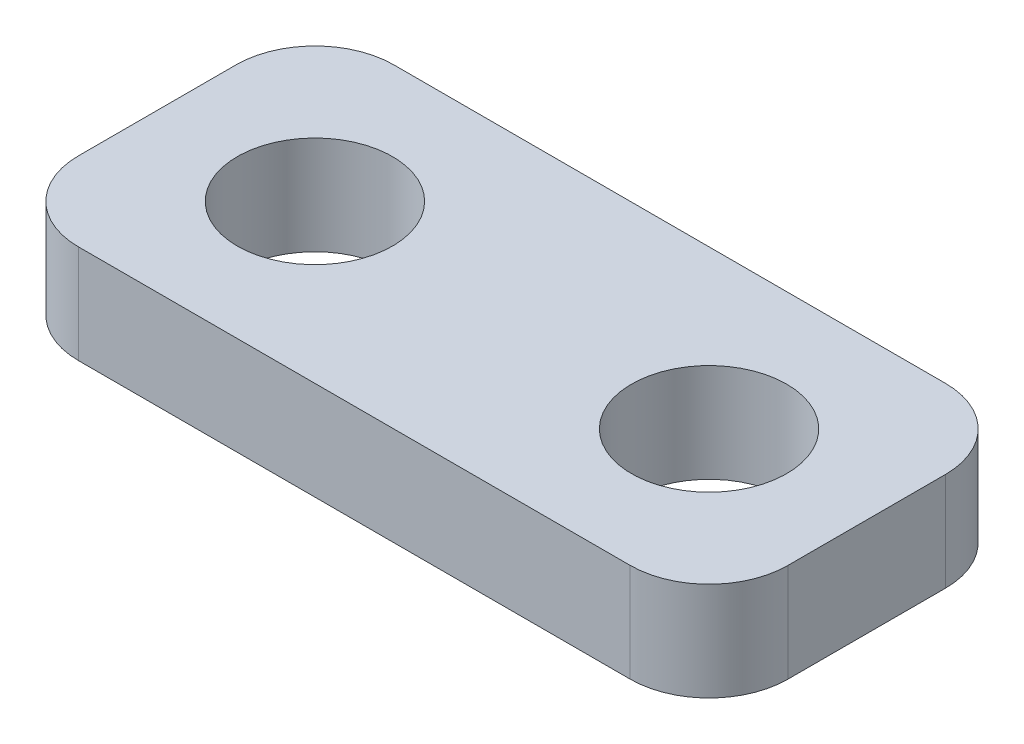
ISO-10303-21;
HEADER;
FILE_DESCRIPTION(('STEP AP214'),'2;1');
FILE_NAME('part.step','',(''),(''),'','','');
FILE_SCHEMA(('AUTOMOTIVE_DESIGN { 1 0 10303 214 1 1 1 1 }'));
ENDSEC;
DATA;
#1=APPLICATION_CONTEXT('core data for automotive mechanical design processes');
#2=APPLICATION_PROTOCOL_DEFINITION('international standard','automotive_design',2000,#1);
#3=PRODUCT_CONTEXT('',#1,'mechanical');
#4=PRODUCT('Part','Part','',(#3));
#5=PRODUCT_RELATED_PRODUCT_CATEGORY('part','',(#4));
#6=PRODUCT_DEFINITION_FORMATION('','',#4);
#7=PRODUCT_DEFINITION_CONTEXT('part definition',#1,'design');
#8=PRODUCT_DEFINITION('design','',#6,#7);
#9=PRODUCT_DEFINITION_SHAPE('','',#8);
#10=(LENGTH_UNIT() NAMED_UNIT(*) SI_UNIT(.MILLI.,.METRE.));
#11=(NAMED_UNIT(*) PLANE_ANGLE_UNIT() SI_UNIT($,.RADIAN.));
#12=(NAMED_UNIT(*) SI_UNIT($,.STERADIAN.) SOLID_ANGLE_UNIT());
#13=UNCERTAINTY_MEASURE_WITH_UNIT(LENGTH_MEASURE(1.E-05),#10,'distance_accuracy_value','');
#14=(GEOMETRIC_REPRESENTATION_CONTEXT(3) GLOBAL_UNCERTAINTY_ASSIGNED_CONTEXT((#13)) GLOBAL_UNIT_ASSIGNED_CONTEXT((#10,
#11,#12)) REPRESENTATION_CONTEXT('',''));
#15=CARTESIAN_POINT('',(0.,0.,0.));
#16=DIRECTION('',(0.,0.,1.));
#17=DIRECTION('',(1.,0.,0.));
#18=AXIS2_PLACEMENT_3D('',#15,#16,#17);
#19=CARTESIAN_POINT('',(11.43,3.175,5.08));
#20=DIRECTION('',(-1.,0.,0.));
#21=DIRECTION('',(0.,0.,1.));
#22=AXIS2_PLACEMENT_3D('',#19,#20,#21);
#23=PLANE('',#22);
#24=DIRECTION('',(0.,0.,-1.));
#25=VECTOR('',#24,1.);
#26=CARTESIAN_POINT('',(11.43,3.175,5.08));
#27=LINE('',#26,#25);
#28=CARTESIAN_POINT('',(11.43,3.175,2.54));
#29=VERTEX_POINT('',#28);
#30=CARTESIAN_POINT('',(11.43,3.175,-2.54));
#31=VERTEX_POINT('',#30);
#32=EDGE_CURVE('E124',#29,#31,#27,.T.);
#33=ORIENTED_EDGE('',*,*,#32,.F.);
#34=DIRECTION('',(0.,-1.,0.));
#35=VECTOR('',#34,1.);
#36=CARTESIAN_POINT('',(11.43,3.175,2.54));
#37=LINE('',#36,#35);
#38=CARTESIAN_POINT('',(11.43,0.,2.54));
#39=VERTEX_POINT('',#38);
#40=EDGE_CURVE('E109',#29,#39,#37,.T.);
#41=ORIENTED_EDGE('',*,*,#40,.T.);
#42=DIRECTION('',(0.,0.,-1.));
#43=VECTOR('',#42,1.);
#44=CARTESIAN_POINT('',(11.43,0.,5.08));
#45=LINE('',#44,#43);
#46=CARTESIAN_POINT('',(11.43,0.,-2.54));
#47=VERTEX_POINT('',#46);
#48=EDGE_CURVE('E121',#39,#47,#45,.T.);
#49=ORIENTED_EDGE('',*,*,#48,.T.);
#50=DIRECTION('',(0.,-1.,0.));
#51=VECTOR('',#50,1.);
#52=CARTESIAN_POINT('',(11.43,3.175,-2.54));
#53=LINE('',#52,#51);
#54=EDGE_CURVE('E126',#47,#31,#53,.F.);
#55=ORIENTED_EDGE('',*,*,#54,.T.);
#56=EDGE_LOOP('',(#33,#41,#49,#55));
#57=FACE_BOUND('',#56,.T.);
#58=ADVANCED_FACE('F39',(#57),#23,.F.);
#59=CARTESIAN_POINT('',(-11.43,3.175,-5.08));
#60=DIRECTION('',(0.,0.,1.));
#61=DIRECTION('',(1.,0.,0.));
#62=AXIS2_PLACEMENT_3D('',#59,#60,#61);
#63=PLANE('',#62);
#64=DIRECTION('',(-1.,0.,0.));
#65=VECTOR('',#64,1.);
#66=CARTESIAN_POINT('',(-11.43,0.,-5.08));
#67=LINE('',#66,#65);
#68=CARTESIAN_POINT('',(8.89,0.,-5.08));
#69=VERTEX_POINT('',#68);
#70=CARTESIAN_POINT('',(-8.89,0.,-5.08));
#71=VERTEX_POINT('',#70);
#72=EDGE_CURVE('E130',#69,#71,#67,.T.);
#73=ORIENTED_EDGE('',*,*,#72,.T.);
#74=DIRECTION('',(0.,-1.,0.));
#75=VECTOR('',#74,1.);
#76=CARTESIAN_POINT('',(-8.89,3.175,-5.08));
#77=LINE('',#76,#75);
#78=CARTESIAN_POINT('',(-8.89,3.175,-5.08));
#79=VERTEX_POINT('',#78);
#80=EDGE_CURVE('E11',#71,#79,#77,.F.);
#81=ORIENTED_EDGE('',*,*,#80,.T.);
#82=DIRECTION('',(-1.,0.,0.));
#83=VECTOR('',#82,1.);
#84=CARTESIAN_POINT('',(-11.43,3.175,-5.08));
#85=LINE('',#84,#83);
#86=CARTESIAN_POINT('',(8.89,3.175,-5.08));
#87=VERTEX_POINT('',#86);
#88=EDGE_CURVE('E170',#87,#79,#85,.T.);
#89=ORIENTED_EDGE('',*,*,#88,.F.);
#90=DIRECTION('',(0.,-1.,0.));
#91=VECTOR('',#90,1.);
#92=CARTESIAN_POINT('',(8.89,3.175,-5.08));
#93=LINE('',#92,#91);
#94=EDGE_CURVE('E47',#87,#69,#93,.T.);
#95=ORIENTED_EDGE('',*,*,#94,.T.);
#96=EDGE_LOOP('',(#73,#81,#89,#95));
#97=FACE_BOUND('',#96,.T.);
#98=ADVANCED_FACE('F168',(#97),#63,.F.);
#99=CARTESIAN_POINT('',(-11.43,3.175,5.08));
#100=DIRECTION('',(1.,0.,0.));
#101=DIRECTION('',(0.,0.,-1.));
#102=AXIS2_PLACEMENT_3D('',#99,#100,#101);
#103=PLANE('',#102);
#104=DIRECTION('',(0.,0.,1.));
#105=VECTOR('',#104,1.);
#106=CARTESIAN_POINT('',(-11.43,0.,5.08));
#107=LINE('',#106,#105);
#108=CARTESIAN_POINT('',(-11.43,0.,-2.54));
#109=VERTEX_POINT('',#108);
#110=CARTESIAN_POINT('',(-11.43,0.,2.54));
#111=VERTEX_POINT('',#110);
#112=EDGE_CURVE('E134',#109,#111,#107,.T.);
#113=ORIENTED_EDGE('',*,*,#112,.T.);
#114=DIRECTION('',(0.,-1.,0.));
#115=VECTOR('',#114,1.);
#116=CARTESIAN_POINT('',(-11.43,3.175,2.54));
#117=LINE('',#116,#115);
#118=CARTESIAN_POINT('',(-11.43,3.175,2.54));
#119=VERTEX_POINT('',#118);
#120=EDGE_CURVE('E54',#111,#119,#117,.F.);
#121=ORIENTED_EDGE('',*,*,#120,.T.);
#122=DIRECTION('',(0.,0.,1.));
#123=VECTOR('',#122,1.);
#124=CARTESIAN_POINT('',(-11.43,3.175,5.08));
#125=LINE('',#124,#123);
#126=CARTESIAN_POINT('',(-11.43,3.175,-2.54));
#127=VERTEX_POINT('',#126);
#128=EDGE_CURVE('E178',#127,#119,#125,.T.);
#129=ORIENTED_EDGE('',*,*,#128,.F.);
#130=DIRECTION('',(0.,-1.,0.));
#131=VECTOR('',#130,1.);
#132=CARTESIAN_POINT('',(-11.43,3.175,-2.54));
#133=LINE('',#132,#131);
#134=EDGE_CURVE('E161',#127,#109,#133,.T.);
#135=ORIENTED_EDGE('',*,*,#134,.T.);
#136=EDGE_LOOP('',(#113,#121,#129,#135));
#137=FACE_BOUND('',#136,.T.);
#138=ADVANCED_FACE('F177',(#137),#103,.F.);
#139=CARTESIAN_POINT('',(-11.43,3.175,5.08));
#140=DIRECTION('',(0.,0.,-1.));
#141=DIRECTION('',(-1.,0.,0.));
#142=AXIS2_PLACEMENT_3D('',#139,#140,#141);
#143=PLANE('',#142);
#144=DIRECTION('',(1.,0.,0.));
#145=VECTOR('',#144,1.);
#146=CARTESIAN_POINT('',(-11.43,0.,5.08));
#147=LINE('',#146,#145);
#148=CARTESIAN_POINT('',(-8.89,0.,5.08));
#149=VERTEX_POINT('',#148);
#150=CARTESIAN_POINT('',(8.89,0.,5.08));
#151=VERTEX_POINT('',#150);
#152=EDGE_CURVE('E144',#149,#151,#147,.T.);
#153=ORIENTED_EDGE('',*,*,#152,.T.);
#154=DIRECTION('',(0.,-1.,0.));
#155=VECTOR('',#154,1.);
#156=CARTESIAN_POINT('',(8.89,3.175,5.08));
#157=LINE('',#156,#155);
#158=CARTESIAN_POINT('',(8.89,3.175,5.08));
#159=VERTEX_POINT('',#158);
#160=EDGE_CURVE('E110',#151,#159,#157,.F.);
#161=ORIENTED_EDGE('',*,*,#160,.T.);
#162=DIRECTION('',(1.,0.,0.));
#163=VECTOR('',#162,1.);
#164=CARTESIAN_POINT('',(-11.43,3.175,5.08));
#165=LINE('',#164,#163);
#166=CARTESIAN_POINT('',(-8.89,3.175,5.08));
#167=VERTEX_POINT('',#166);
#168=EDGE_CURVE('E140',#167,#159,#165,.T.);
#169=ORIENTED_EDGE('',*,*,#168,.F.);
#170=DIRECTION('',(0.,-1.,0.));
#171=VECTOR('',#170,1.);
#172=CARTESIAN_POINT('',(-8.89,3.175,5.08));
#173=LINE('',#172,#171);
#174=EDGE_CURVE('E115',#167,#149,#173,.T.);
#175=ORIENTED_EDGE('',*,*,#174,.T.);
#176=EDGE_LOOP('',(#153,#161,#169,#175));
#177=FACE_BOUND('',#176,.T.);
#178=ADVANCED_FACE('F198',(#177),#143,.F.);
#179=CARTESIAN_POINT('',(0.,3.175,0.));
#180=DIRECTION('',(0.,-1.,0.));
#181=DIRECTION('',(0.,0.,-1.));
#182=AXIS2_PLACEMENT_3D('',#179,#180,#181);
#183=PLANE('',#182);
#184=CARTESIAN_POINT('',(-6.35,3.175,0.));
#185=DIRECTION('',(0.,1.,0.));
#186=DIRECTION('',(0.,0.,1.));
#187=AXIS2_PLACEMENT_3D('',#184,#185,#186);
#188=CIRCLE('',#187,2.5);
#189=CARTESIAN_POINT('',(-6.35,3.175,2.5));
#190=VERTEX_POINT('',#189);
#191=EDGE_CURVE('E137',#190,#190,#188,.T.);
#192=ORIENTED_EDGE('',*,*,#191,.F.);
#193=EDGE_LOOP('',(#192));
#194=FACE_BOUND('',#193,.T.);
#195=CARTESIAN_POINT('',(6.35,3.175,0.));
#196=DIRECTION('',(0.,1.,0.));
#197=DIRECTION('',(0.,0.,-1.));
#198=AXIS2_PLACEMENT_3D('',#195,#196,#197);
#199=CIRCLE('',#198,2.5);
#200=CARTESIAN_POINT('',(6.35,3.175,-2.5));
#201=VERTEX_POINT('',#200);
#202=EDGE_CURVE('E187',#201,#201,#199,.T.);
#203=ORIENTED_EDGE('',*,*,#202,.F.);
#204=EDGE_LOOP('',(#203));
#205=FACE_BOUND('',#204,.T.);
#206=ORIENTED_EDGE('',*,*,#168,.T.);
#207=CARTESIAN_POINT('',(8.89,3.175,2.54));
#208=DIRECTION('',(0.,-1.,0.));
#209=DIRECTION('',(0.,0.,-1.));
#210=AXIS2_PLACEMENT_3D('',#207,#208,#209);
#211=CIRCLE('',#210,2.54);
#212=EDGE_CURVE('E159',#159,#29,#211,.F.);
#213=ORIENTED_EDGE('',*,*,#212,.T.);
#214=ORIENTED_EDGE('',*,*,#32,.T.);
#215=CARTESIAN_POINT('',(8.89,3.175,-2.54));
#216=DIRECTION('',(0.,-1.,0.));
#217=DIRECTION('',(0.,0.,-1.));
#218=AXIS2_PLACEMENT_3D('',#215,#216,#217);
#219=CIRCLE('',#218,2.54);
#220=EDGE_CURVE('E154',#31,#87,#219,.F.);
#221=ORIENTED_EDGE('',*,*,#220,.T.);
#222=ORIENTED_EDGE('',*,*,#88,.T.);
#223=CARTESIAN_POINT('',(-8.89,3.175,-2.54));
#224=DIRECTION('',(0.,-1.,0.));
#225=DIRECTION('',(0.,0.,-1.));
#226=AXIS2_PLACEMENT_3D('',#223,#224,#225);
#227=CIRCLE('',#226,2.54);
#228=EDGE_CURVE('E61',#79,#127,#227,.F.);
#229=ORIENTED_EDGE('',*,*,#228,.T.);
#230=ORIENTED_EDGE('',*,*,#128,.T.);
#231=CARTESIAN_POINT('',(-8.89,3.175,2.54));
#232=DIRECTION('',(0.,-1.,0.));
#233=DIRECTION('',(0.,0.,-1.));
#234=AXIS2_PLACEMENT_3D('',#231,#232,#233);
#235=CIRCLE('',#234,2.54);
#236=EDGE_CURVE('E157',#119,#167,#235,.F.);
#237=ORIENTED_EDGE('',*,*,#236,.T.);
#238=EDGE_LOOP('',(#206,#213,#214,#221,#222,#229,#230,#237));
#239=FACE_BOUND('',#238,.T.);
#240=ADVANCED_FACE('F195',(#194,#205,#239),#183,.F.);
#241=CARTESIAN_POINT('',(0.,0.,0.));
#242=DIRECTION('',(0.,-1.,0.));
#243=DIRECTION('',(0.,0.,-1.));
#244=AXIS2_PLACEMENT_3D('',#241,#242,#243);
#245=PLANE('',#244);
#246=CARTESIAN_POINT('',(-6.35,0.,0.));
#247=DIRECTION('',(0.,1.,0.));
#248=DIRECTION('',(0.,0.,1.));
#249=AXIS2_PLACEMENT_3D('',#246,#247,#248);
#250=CIRCLE('',#249,2.5);
#251=CARTESIAN_POINT('',(-6.35,0.,2.5));
#252=VERTEX_POINT('',#251);
#253=EDGE_CURVE('E131',#252,#252,#250,.T.);
#254=ORIENTED_EDGE('',*,*,#253,.T.);
#255=EDGE_LOOP('',(#254));
#256=FACE_BOUND('',#255,.T.);
#257=CARTESIAN_POINT('',(6.35,0.,0.));
#258=DIRECTION('',(0.,1.,0.));
#259=DIRECTION('',(0.,0.,-1.));
#260=AXIS2_PLACEMENT_3D('',#257,#258,#259);
#261=CIRCLE('',#260,2.5);
#262=CARTESIAN_POINT('',(6.35,0.,-2.5));
#263=VERTEX_POINT('',#262);
#264=EDGE_CURVE('E184',#263,#263,#261,.T.);
#265=ORIENTED_EDGE('',*,*,#264,.T.);
#266=EDGE_LOOP('',(#265));
#267=FACE_BOUND('',#266,.T.);
#268=ORIENTED_EDGE('',*,*,#48,.F.);
#269=CARTESIAN_POINT('',(8.89,0.,2.54));
#270=DIRECTION('',(0.,-1.,0.));
#271=DIRECTION('',(0.,0.,-1.));
#272=AXIS2_PLACEMENT_3D('',#269,#270,#271);
#273=CIRCLE('',#272,2.54);
#274=EDGE_CURVE('E105',#39,#151,#273,.T.);
#275=ORIENTED_EDGE('',*,*,#274,.T.);
#276=ORIENTED_EDGE('',*,*,#152,.F.);
#277=CARTESIAN_POINT('',(-8.89,0.,2.54));
#278=DIRECTION('',(0.,-1.,0.));
#279=DIRECTION('',(0.,0.,-1.));
#280=AXIS2_PLACEMENT_3D('',#277,#278,#279);
#281=CIRCLE('',#280,2.54);
#282=EDGE_CURVE('E116',#149,#111,#281,.T.);
#283=ORIENTED_EDGE('',*,*,#282,.T.);
#284=ORIENTED_EDGE('',*,*,#112,.F.);
#285=CARTESIAN_POINT('',(-8.89,0.,-2.54));
#286=DIRECTION('',(0.,-1.,0.));
#287=DIRECTION('',(0.,0.,-1.));
#288=AXIS2_PLACEMENT_3D('',#285,#286,#287);
#289=CIRCLE('',#288,2.54);
#290=EDGE_CURVE('E148',#109,#71,#289,.T.);
#291=ORIENTED_EDGE('',*,*,#290,.T.);
#292=ORIENTED_EDGE('',*,*,#72,.F.);
#293=CARTESIAN_POINT('',(8.89,0.,-2.54));
#294=DIRECTION('',(0.,-1.,0.));
#295=DIRECTION('',(0.,0.,-1.));
#296=AXIS2_PLACEMENT_3D('',#293,#294,#295);
#297=CIRCLE('',#296,2.54);
#298=EDGE_CURVE('E125',#69,#47,#297,.T.);
#299=ORIENTED_EDGE('',*,*,#298,.T.);
#300=EDGE_LOOP('',(#268,#275,#276,#283,#284,#291,#292,#299));
#301=FACE_BOUND('',#300,.T.);
#302=ADVANCED_FACE('F128',(#256,#267,#301),#245,.T.);
#303=CARTESIAN_POINT('',(6.35,0.,0.));
#304=DIRECTION('',(0.,1.,0.));
#305=DIRECTION('',(0.,0.,1.));
#306=AXIS2_PLACEMENT_3D('',#303,#304,#305);
#307=CYLINDRICAL_SURFACE('',#306,2.5);
#308=ORIENTED_EDGE('',*,*,#264,.F.);
#309=EDGE_LOOP('',(#308));
#310=FACE_BOUND('',#309,.T.);
#311=ORIENTED_EDGE('',*,*,#202,.T.);
#312=EDGE_LOOP('',(#311));
#313=FACE_BOUND('',#312,.T.);
#314=ADVANCED_FACE('F226',(#310,#313),#307,.F.);
#315=CARTESIAN_POINT('',(-6.35,0.,0.));
#316=DIRECTION('',(0.,1.,0.));
#317=DIRECTION('',(0.,0.,1.));
#318=AXIS2_PLACEMENT_3D('',#315,#316,#317);
#319=CYLINDRICAL_SURFACE('',#318,2.5);
#320=ORIENTED_EDGE('',*,*,#253,.F.);
#321=EDGE_LOOP('',(#320));
#322=FACE_BOUND('',#321,.T.);
#323=ORIENTED_EDGE('',*,*,#191,.T.);
#324=EDGE_LOOP('',(#323));
#325=FACE_BOUND('',#324,.T.);
#326=ADVANCED_FACE('F193',(#322,#325),#319,.F.);
#327=CARTESIAN_POINT('',(8.89,3.175,2.54));
#328=DIRECTION('',(0.,-1.,0.));
#329=DIRECTION('',(0.,0.,-1.));
#330=AXIS2_PLACEMENT_3D('',#327,#328,#329);
#331=CYLINDRICAL_SURFACE('',#330,2.54);
#332=ORIENTED_EDGE('',*,*,#212,.F.);
#333=ORIENTED_EDGE('',*,*,#160,.F.);
#334=ORIENTED_EDGE('',*,*,#274,.F.);
#335=ORIENTED_EDGE('',*,*,#40,.F.);
#336=EDGE_LOOP('',(#332,#333,#334,#335));
#337=FACE_BOUND('',#336,.T.);
#338=ADVANCED_FACE('F108',(#337),#331,.T.);
#339=CARTESIAN_POINT('',(-8.89,3.175,2.54));
#340=DIRECTION('',(0.,-1.,0.));
#341=DIRECTION('',(0.,0.,-1.));
#342=AXIS2_PLACEMENT_3D('',#339,#340,#341);
#343=CYLINDRICAL_SURFACE('',#342,2.54);
#344=ORIENTED_EDGE('',*,*,#236,.F.);
#345=ORIENTED_EDGE('',*,*,#120,.F.);
#346=ORIENTED_EDGE('',*,*,#282,.F.);
#347=ORIENTED_EDGE('',*,*,#174,.F.);
#348=EDGE_LOOP('',(#344,#345,#346,#347));
#349=FACE_BOUND('',#348,.T.);
#350=ADVANCED_FACE('F205',(#349),#343,.T.);
#351=CARTESIAN_POINT('',(-8.89,3.175,-2.54));
#352=DIRECTION('',(0.,-1.,0.));
#353=DIRECTION('',(0.,0.,-1.));
#354=AXIS2_PLACEMENT_3D('',#351,#352,#353);
#355=CYLINDRICAL_SURFACE('',#354,2.54);
#356=ORIENTED_EDGE('',*,*,#228,.F.);
#357=ORIENTED_EDGE('',*,*,#80,.F.);
#358=ORIENTED_EDGE('',*,*,#290,.F.);
#359=ORIENTED_EDGE('',*,*,#134,.F.);
#360=EDGE_LOOP('',(#356,#357,#358,#359));
#361=FACE_BOUND('',#360,.T.);
#362=ADVANCED_FACE('F176',(#361),#355,.T.);
#363=CARTESIAN_POINT('',(8.89,3.175,-2.54));
#364=DIRECTION('',(0.,-1.,0.));
#365=DIRECTION('',(0.,0.,-1.));
#366=AXIS2_PLACEMENT_3D('',#363,#364,#365);
#367=CYLINDRICAL_SURFACE('',#366,2.54);
#368=ORIENTED_EDGE('',*,*,#220,.F.);
#369=ORIENTED_EDGE('',*,*,#54,.F.);
#370=ORIENTED_EDGE('',*,*,#298,.F.);
#371=ORIENTED_EDGE('',*,*,#94,.F.);
#372=EDGE_LOOP('',(#368,#369,#370,#371));
#373=FACE_BOUND('',#372,.T.);
#374=ADVANCED_FACE('F41',(#373),#367,.T.);
#375=CLOSED_SHELL('',(#58,#98,#138,#178,#240,#302,#314,#326,#338,#350,#362,#374));
#376=MANIFOLD_SOLID_BREP('B2',#375);
#377=ADVANCED_BREP_SHAPE_REPRESENTATION('',(#18,#376),#14);
#378=SHAPE_DEFINITION_REPRESENTATION(#9,#377);
ENDSEC;
END-ISO-10303-21;
